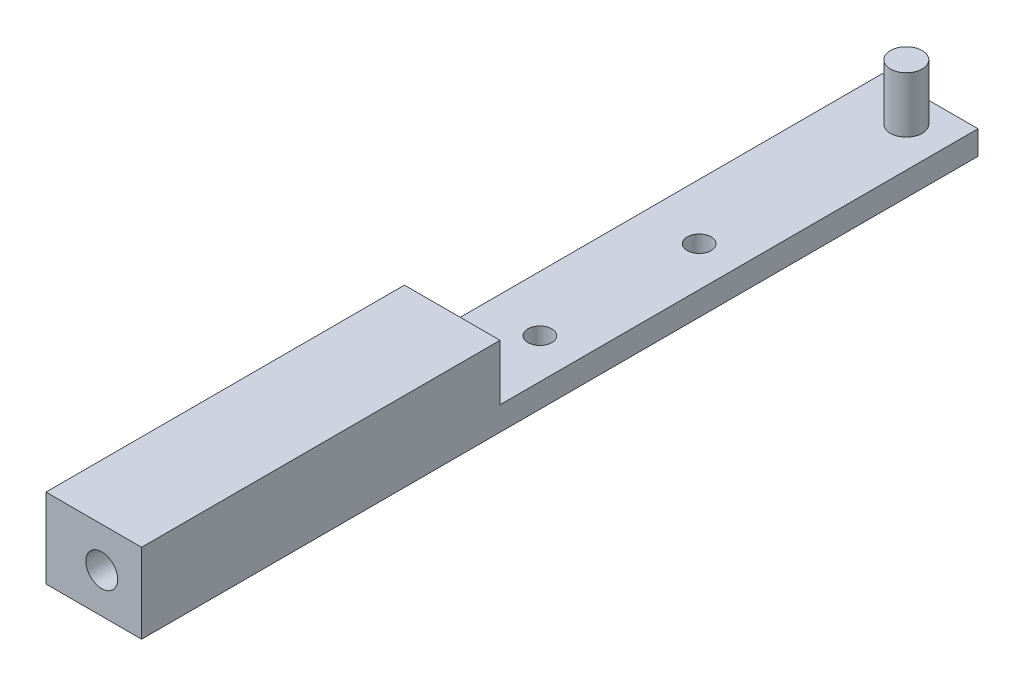
ISO-10303-21;
HEADER;
FILE_DESCRIPTION(('STEP AP214'),'2;1');
FILE_NAME('part.step','',(''),(''),'','','');
FILE_SCHEMA(('AUTOMOTIVE_DESIGN { 1 0 10303 214 1 1 1 1 }'));
ENDSEC;
DATA;
#1=APPLICATION_CONTEXT('core data for automotive mechanical design processes');
#2=APPLICATION_PROTOCOL_DEFINITION('international standard','automotive_design',2000,#1);
#3=PRODUCT_CONTEXT('',#1,'mechanical');
#4=PRODUCT('Part','Part','',(#3));
#5=PRODUCT_RELATED_PRODUCT_CATEGORY('part','',(#4));
#6=PRODUCT_DEFINITION_FORMATION('','',#4);
#7=PRODUCT_DEFINITION_CONTEXT('part definition',#1,'design');
#8=PRODUCT_DEFINITION('design','',#6,#7);
#9=PRODUCT_DEFINITION_SHAPE('','',#8);
#10=(LENGTH_UNIT() NAMED_UNIT(*) SI_UNIT(.MILLI.,.METRE.));
#11=(NAMED_UNIT(*) PLANE_ANGLE_UNIT() SI_UNIT($,.RADIAN.));
#12=(NAMED_UNIT(*) SI_UNIT($,.STERADIAN.) SOLID_ANGLE_UNIT());
#13=UNCERTAINTY_MEASURE_WITH_UNIT(LENGTH_MEASURE(1.E-05),#10,'distance_accuracy_value','');
#14=(GEOMETRIC_REPRESENTATION_CONTEXT(3) GLOBAL_UNCERTAINTY_ASSIGNED_CONTEXT((#13)) GLOBAL_UNIT_ASSIGNED_CONTEXT((#10,
#11,#12)) REPRESENTATION_CONTEXT('',''));
#15=CARTESIAN_POINT('',(0.,0.,0.));
#16=DIRECTION('',(0.,0.,1.));
#17=DIRECTION('',(1.,0.,0.));
#18=AXIS2_PLACEMENT_3D('',#15,#16,#17);
#19=CARTESIAN_POINT('',(4.99999999999999,10.,-52.5));
#20=DIRECTION('',(-1.,0.,0.));
#21=DIRECTION('',(0.,0.,1.));
#22=AXIS2_PLACEMENT_3D('',#19,#20,#21);
#23=PLANE('',#22);
#24=DIRECTION('',(0.,-1.,0.));
#25=VECTOR('',#24,1.);
#26=CARTESIAN_POINT('',(5.,9.99999999999999,7.50000000000001));
#27=LINE('',#26,#25);
#28=CARTESIAN_POINT('',(5.00000000000001,10.,7.50000000000001));
#29=VERTEX_POINT('',#28);
#30=CARTESIAN_POINT('',(5.,2.99999999999999,7.50000000000001));
#31=VERTEX_POINT('',#30);
#32=EDGE_CURVE('E97',#29,#31,#27,.T.);
#33=ORIENTED_EDGE('',*,*,#32,.F.);
#34=DIRECTION('',(0.,0.,-1.));
#35=VECTOR('',#34,1.);
#36=CARTESIAN_POINT('',(4.99999999999999,10.,-52.5));
#37=LINE('',#36,#35);
#38=CARTESIAN_POINT('',(5.00000000000001,10.,52.5));
#39=VERTEX_POINT('',#38);
#40=EDGE_CURVE('E144',#39,#29,#37,.T.);
#41=ORIENTED_EDGE('',*,*,#40,.F.);
#42=DIRECTION('',(0.,-1.,0.));
#43=VECTOR('',#42,1.);
#44=CARTESIAN_POINT('',(5.00000000000001,10.,52.5));
#45=LINE('',#44,#43);
#46=CARTESIAN_POINT('',(5.00000000000001,0.,52.5));
#47=VERTEX_POINT('',#46);
#48=EDGE_CURVE('E148',#39,#47,#45,.T.);
#49=ORIENTED_EDGE('',*,*,#48,.T.);
#50=DIRECTION('',(0.,0.,-1.));
#51=VECTOR('',#50,1.);
#52=CARTESIAN_POINT('',(4.99999999999999,0.,-52.5));
#53=LINE('',#52,#51);
#54=CARTESIAN_POINT('',(4.99999999999999,0.,-52.5));
#55=VERTEX_POINT('',#54);
#56=EDGE_CURVE('E143',#47,#55,#53,.T.);
#57=ORIENTED_EDGE('',*,*,#56,.T.);
#58=DIRECTION('',(0.,-1.,0.));
#59=VECTOR('',#58,1.);
#60=CARTESIAN_POINT('',(4.99999999999999,10.,-52.5));
#61=LINE('',#60,#59);
#62=CARTESIAN_POINT('',(4.99999999999999,3.,-52.5));
#63=VERTEX_POINT('',#62);
#64=EDGE_CURVE('E43',#63,#55,#61,.T.);
#65=ORIENTED_EDGE('',*,*,#64,.F.);
#66=DIRECTION('',(0.,0.,-1.));
#67=VECTOR('',#66,1.);
#68=CARTESIAN_POINT('',(4.99999999999999,3.,-52.5));
#69=LINE('',#68,#67);
#70=EDGE_CURVE('E70',#31,#63,#69,.T.);
#71=ORIENTED_EDGE('',*,*,#70,.F.);
#72=EDGE_LOOP('',(#33,#41,#49,#57,#65,#71));
#73=FACE_BOUND('',#72,.T.);
#74=ADVANCED_FACE('F34',(#73),#23,.F.);
#75=CARTESIAN_POINT('',(-5.00000000000001,10.,-52.5));
#76=DIRECTION('',(0.,0.,1.));
#77=DIRECTION('',(1.,0.,0.));
#78=AXIS2_PLACEMENT_3D('',#75,#76,#77);
#79=PLANE('',#78);
#80=DIRECTION('',(-1.,0.,0.));
#81=VECTOR('',#80,1.);
#82=CARTESIAN_POINT('',(10.,3.,-52.5));
#83=LINE('',#82,#81);
#84=CARTESIAN_POINT('',(-7.00000000000001,3.,-52.5));
#85=VERTEX_POINT('',#84);
#86=EDGE_CURVE('E98',#63,#85,#83,.T.);
#87=ORIENTED_EDGE('',*,*,#86,.F.);
#88=ORIENTED_EDGE('',*,*,#64,.T.);
#89=DIRECTION('',(-1.,0.,0.));
#90=VECTOR('',#89,1.);
#91=CARTESIAN_POINT('',(-5.00000000000001,0.,-52.5));
#92=LINE('',#91,#90);
#93=CARTESIAN_POINT('',(-7.00000000000001,0.,-52.5));
#94=VERTEX_POINT('',#93);
#95=EDGE_CURVE('E151',#55,#94,#92,.T.);
#96=ORIENTED_EDGE('',*,*,#95,.T.);
#97=DIRECTION('',(0.,-1.,0.));
#98=VECTOR('',#97,1.);
#99=CARTESIAN_POINT('',(-7.00000000000001,0.,-52.5));
#100=LINE('',#99,#98);
#101=EDGE_CURVE('E106',#85,#94,#100,.T.);
#102=ORIENTED_EDGE('',*,*,#101,.F.);
#103=EDGE_LOOP('',(#87,#88,#96,#102));
#104=FACE_BOUND('',#103,.T.);
#105=ADVANCED_FACE('F186',(#104),#79,.F.);
#106=CARTESIAN_POINT('',(0.,10.,0.));
#107=DIRECTION('',(0.,1.,0.));
#108=DIRECTION('',(0.,0.,1.));
#109=AXIS2_PLACEMENT_3D('',#106,#107,#108);
#110=PLANE('',#109);
#111=ORIENTED_EDGE('',*,*,#40,.T.);
#112=DIRECTION('',(-1.,0.,0.));
#113=VECTOR('',#112,1.);
#114=CARTESIAN_POINT('',(0.,10.,7.50000000000001));
#115=LINE('',#114,#113);
#116=CARTESIAN_POINT('',(-7.,10.,7.50000000000001));
#117=VERTEX_POINT('',#116);
#118=EDGE_CURVE('E11',#29,#117,#115,.T.);
#119=ORIENTED_EDGE('',*,*,#118,.T.);
#120=DIRECTION('',(0.,0.,-1.));
#121=VECTOR('',#120,1.);
#122=CARTESIAN_POINT('',(-7.,10.,7.50000000000001));
#123=LINE('',#122,#121);
#124=CARTESIAN_POINT('',(-6.99999999999999,10.,52.5));
#125=VERTEX_POINT('',#124);
#126=EDGE_CURVE('E111',#125,#117,#123,.T.);
#127=ORIENTED_EDGE('',*,*,#126,.F.);
#128=DIRECTION('',(1.,0.,0.));
#129=VECTOR('',#128,1.);
#130=CARTESIAN_POINT('',(-4.99999999999999,10.,52.5));
#131=LINE('',#130,#129);
#132=EDGE_CURVE('E51',#125,#39,#131,.T.);
#133=ORIENTED_EDGE('',*,*,#132,.T.);
#134=EDGE_LOOP('',(#111,#119,#127,#133));
#135=FACE_BOUND('',#134,.T.);
#136=ADVANCED_FACE('F184',(#135),#110,.T.);
#137=CARTESIAN_POINT('',(-4.99999999999999,10.,52.5));
#138=DIRECTION('',(0.,0.,-1.));
#139=DIRECTION('',(-1.,0.,0.));
#140=AXIS2_PLACEMENT_3D('',#137,#138,#139);
#141=PLANE('',#140);
#142=CARTESIAN_POINT('',(0.,5.,52.5));
#143=DIRECTION('',(0.,0.,1.));
#144=DIRECTION('',(1.,0.,0.));
#145=AXIS2_PLACEMENT_3D('',#142,#143,#144);
#146=CIRCLE('',#145,2.);
#147=CARTESIAN_POINT('',(2.,5.,52.5));
#148=VERTEX_POINT('',#147);
#149=EDGE_CURVE('E121',#148,#148,#146,.T.);
#150=ORIENTED_EDGE('',*,*,#149,.F.);
#151=EDGE_LOOP('',(#150));
#152=FACE_BOUND('',#151,.T.);
#153=DIRECTION('',(1.,0.,0.));
#154=VECTOR('',#153,1.);
#155=CARTESIAN_POINT('',(-4.99999999999999,0.,52.5));
#156=LINE('',#155,#154);
#157=CARTESIAN_POINT('',(-6.99999999999999,0.,52.5));
#158=VERTEX_POINT('',#157);
#159=EDGE_CURVE('E146',#158,#47,#156,.T.);
#160=ORIENTED_EDGE('',*,*,#159,.T.);
#161=ORIENTED_EDGE('',*,*,#48,.F.);
#162=ORIENTED_EDGE('',*,*,#132,.F.);
#163=DIRECTION('',(0.,1.,0.));
#164=VECTOR('',#163,1.);
#165=CARTESIAN_POINT('',(-6.99999999999999,10.,52.5));
#166=LINE('',#165,#164);
#167=EDGE_CURVE('E118',#158,#125,#166,.T.);
#168=ORIENTED_EDGE('',*,*,#167,.F.);
#169=EDGE_LOOP('',(#160,#161,#162,#168));
#170=FACE_BOUND('',#169,.T.);
#171=ADVANCED_FACE('F174',(#152,#170),#141,.F.);
#172=CARTESIAN_POINT('',(0.,0.,0.));
#173=DIRECTION('',(0.,1.,0.));
#174=DIRECTION('',(0.,0.,1.));
#175=AXIS2_PLACEMENT_3D('',#172,#173,#174);
#176=PLANE('',#175);
#177=CARTESIAN_POINT('',(0.,0.,-2.49999999999999));
#178=DIRECTION('',(0.,1.,0.));
#179=DIRECTION('',(0.,0.,1.));
#180=AXIS2_PLACEMENT_3D('',#177,#178,#179);
#181=CIRCLE('',#180,1.5);
#182=CARTESIAN_POINT('',(0.,0.,-0.999999999999988));
#183=VERTEX_POINT('',#182);
#184=EDGE_CURVE('E128',#183,#183,#181,.T.);
#185=ORIENTED_EDGE('',*,*,#184,.T.);
#186=EDGE_LOOP('',(#185));
#187=FACE_BOUND('',#186,.T.);
#188=CARTESIAN_POINT('',(0.,0.,-22.5));
#189=DIRECTION('',(0.,1.,0.));
#190=DIRECTION('',(0.,0.,1.));
#191=AXIS2_PLACEMENT_3D('',#188,#189,#190);
#192=CIRCLE('',#191,1.5);
#193=CARTESIAN_POINT('',(0.,0.,-21.));
#194=VERTEX_POINT('',#193);
#195=EDGE_CURVE('E125',#194,#194,#192,.T.);
#196=ORIENTED_EDGE('',*,*,#195,.T.);
#197=EDGE_LOOP('',(#196));
#198=FACE_BOUND('',#197,.T.);
#199=ORIENTED_EDGE('',*,*,#56,.F.);
#200=ORIENTED_EDGE('',*,*,#159,.F.);
#201=DIRECTION('',(0.,0.,1.));
#202=VECTOR('',#201,1.);
#203=CARTESIAN_POINT('',(-6.99999999999999,0.,52.5));
#204=LINE('',#203,#202);
#205=EDGE_CURVE('E115',#94,#158,#204,.T.);
#206=ORIENTED_EDGE('',*,*,#205,.F.);
#207=ORIENTED_EDGE('',*,*,#95,.F.);
#208=EDGE_LOOP('',(#199,#200,#206,#207));
#209=FACE_BOUND('',#208,.T.);
#210=ADVANCED_FACE('F171',(#187,#198,#209),#176,.F.);
#211=CARTESIAN_POINT('',(10.,3.,-52.5));
#212=DIRECTION('',(0.,1.,0.));
#213=DIRECTION('',(0.,0.,1.));
#214=AXIS2_PLACEMENT_3D('',#211,#212,#213);
#215=PLANE('',#214);
#216=CARTESIAN_POINT('',(0.,2.99999999999999,-2.49999999999999));
#217=DIRECTION('',(0.,1.,0.));
#218=DIRECTION('',(0.,0.,1.));
#219=AXIS2_PLACEMENT_3D('',#216,#217,#218);
#220=CIRCLE('',#219,1.5);
#221=CARTESIAN_POINT('',(0.,2.99999999999999,-0.999999999999988));
#222=VERTEX_POINT('',#221);
#223=EDGE_CURVE('E37',#222,#222,#220,.F.);
#224=ORIENTED_EDGE('',*,*,#223,.T.);
#225=EDGE_LOOP('',(#224));
#226=FACE_BOUND('',#225,.T.);
#227=CARTESIAN_POINT('',(0.,3.,-22.5));
#228=DIRECTION('',(0.,1.,0.));
#229=DIRECTION('',(0.,0.,1.));
#230=AXIS2_PLACEMENT_3D('',#227,#228,#229);
#231=CIRCLE('',#230,1.5);
#232=CARTESIAN_POINT('',(0.,3.,-21.));
#233=VERTEX_POINT('',#232);
#234=EDGE_CURVE('E131',#233,#233,#231,.F.);
#235=ORIENTED_EDGE('',*,*,#234,.T.);
#236=EDGE_LOOP('',(#235));
#237=FACE_BOUND('',#236,.T.);
#238=CARTESIAN_POINT('',(0.,3.,-48.5));
#239=DIRECTION('',(0.,1.,0.));
#240=DIRECTION('',(0.,0.,1.));
#241=AXIS2_PLACEMENT_3D('',#238,#239,#240);
#242=CIRCLE('',#241,2.);
#243=CARTESIAN_POINT('',(0.,3.,-46.5));
#244=VERTEX_POINT('',#243);
#245=EDGE_CURVE('E137',#244,#244,#242,.T.);
#246=ORIENTED_EDGE('',*,*,#245,.F.);
#247=EDGE_LOOP('',(#246));
#248=FACE_BOUND('',#247,.T.);
#249=ORIENTED_EDGE('',*,*,#70,.T.);
#250=ORIENTED_EDGE('',*,*,#86,.T.);
#251=DIRECTION('',(0.,0.,-1.));
#252=VECTOR('',#251,1.);
#253=CARTESIAN_POINT('',(-7.00000000000001,3.,-52.5));
#254=LINE('',#253,#252);
#255=CARTESIAN_POINT('',(-7.,2.99999999999999,7.50000000000001));
#256=VERTEX_POINT('',#255);
#257=EDGE_CURVE('E101',#256,#85,#254,.T.);
#258=ORIENTED_EDGE('',*,*,#257,.F.);
#259=DIRECTION('',(-1.,0.,0.));
#260=VECTOR('',#259,1.);
#261=CARTESIAN_POINT('',(10.,2.99999999999999,7.50000000000001));
#262=LINE('',#261,#260);
#263=EDGE_CURVE('E92',#31,#256,#262,.T.);
#264=ORIENTED_EDGE('',*,*,#263,.F.);
#265=EDGE_LOOP('',(#249,#250,#258,#264));
#266=FACE_BOUND('',#265,.T.);
#267=ADVANCED_FACE('F102',(#226,#237,#248,#266),#215,.T.);
#268=CARTESIAN_POINT('',(10.,16.0957121015767,7.50000000000001));
#269=DIRECTION('',(0.,0.,-1.));
#270=DIRECTION('',(0.,1.,0.));
#271=AXIS2_PLACEMENT_3D('',#268,#269,#270);
#272=PLANE('',#271);
#273=ORIENTED_EDGE('',*,*,#32,.T.);
#274=ORIENTED_EDGE('',*,*,#263,.T.);
#275=DIRECTION('',(0.,-1.,0.));
#276=VECTOR('',#275,1.);
#277=CARTESIAN_POINT('',(-7.,2.99999999999999,7.50000000000001));
#278=LINE('',#277,#276);
#279=EDGE_CURVE('E96',#117,#256,#278,.T.);
#280=ORIENTED_EDGE('',*,*,#279,.F.);
#281=ORIENTED_EDGE('',*,*,#118,.F.);
#282=EDGE_LOOP('',(#273,#274,#280,#281));
#283=FACE_BOUND('',#282,.T.);
#284=ADVANCED_FACE('F94',(#283),#272,.T.);
#285=CARTESIAN_POINT('',(0.,10.,-48.5));
#286=DIRECTION('',(0.,-1.,0.));
#287=DIRECTION('',(0.,0.,-1.));
#288=AXIS2_PLACEMENT_3D('',#285,#286,#287);
#289=CYLINDRICAL_SURFACE('',#288,2.);
#290=CARTESIAN_POINT('',(0.,10.,-48.5));
#291=DIRECTION('',(0.,1.,0.));
#292=DIRECTION('',(0.,0.,1.));
#293=AXIS2_PLACEMENT_3D('',#290,#291,#292);
#294=CIRCLE('',#293,2.);
#295=CARTESIAN_POINT('',(0.,10.,-46.5));
#296=VERTEX_POINT('',#295);
#297=EDGE_CURVE('E134',#296,#296,#294,.T.);
#298=ORIENTED_EDGE('',*,*,#297,.F.);
#299=EDGE_LOOP('',(#298));
#300=FACE_BOUND('',#299,.T.);
#301=ORIENTED_EDGE('',*,*,#245,.T.);
#302=EDGE_LOOP('',(#301));
#303=FACE_BOUND('',#302,.T.);
#304=ADVANCED_FACE('F247',(#300,#303),#289,.T.);
#305=CARTESIAN_POINT('',(0.,10.,-48.5));
#306=DIRECTION('',(0.,1.,0.));
#307=DIRECTION('',(0.,0.,1.));
#308=AXIS2_PLACEMENT_3D('',#305,#306,#307);
#309=PLANE('',#308);
#310=ORIENTED_EDGE('',*,*,#297,.T.);
#311=EDGE_LOOP('',(#310));
#312=FACE_BOUND('',#311,.T.);
#313=ADVANCED_FACE('F277',(#312),#309,.T.);
#314=CARTESIAN_POINT('',(0.,14.,-22.5));
#315=DIRECTION('',(0.,-1.,0.));
#316=DIRECTION('',(0.,0.,-1.));
#317=AXIS2_PLACEMENT_3D('',#314,#315,#316);
#318=CYLINDRICAL_SURFACE('',#317,1.5);
#319=ORIENTED_EDGE('',*,*,#234,.F.);
#320=EDGE_LOOP('',(#319));
#321=FACE_BOUND('',#320,.T.);
#322=ORIENTED_EDGE('',*,*,#195,.F.);
#323=EDGE_LOOP('',(#322));
#324=FACE_BOUND('',#323,.T.);
#325=ADVANCED_FACE('F167',(#321,#324),#318,.F.);
#326=CARTESIAN_POINT('',(0.,14.,-2.49999999999999));
#327=DIRECTION('',(0.,-1.,0.));
#328=DIRECTION('',(0.,0.,-1.));
#329=AXIS2_PLACEMENT_3D('',#326,#327,#328);
#330=CYLINDRICAL_SURFACE('',#329,1.5);
#331=ORIENTED_EDGE('',*,*,#223,.F.);
#332=EDGE_LOOP('',(#331));
#333=FACE_BOUND('',#332,.T.);
#334=ORIENTED_EDGE('',*,*,#184,.F.);
#335=EDGE_LOOP('',(#334));
#336=FACE_BOUND('',#335,.T.);
#337=ADVANCED_FACE('F163',(#333,#336),#330,.F.);
#338=CARTESIAN_POINT('',(0.,5.,42.5));
#339=DIRECTION('',(0.,0.,1.));
#340=DIRECTION('',(1.,0.,0.));
#341=AXIS2_PLACEMENT_3D('',#338,#339,#340);
#342=CYLINDRICAL_SURFACE('',#341,2.);
#343=CARTESIAN_POINT('',(0.,5.,42.5));
#344=DIRECTION('',(0.,0.,1.));
#345=DIRECTION('',(1.,0.,0.));
#346=AXIS2_PLACEMENT_3D('',#343,#344,#345);
#347=CIRCLE('',#346,2.);
#348=CARTESIAN_POINT('',(2.,5.,42.5));
#349=VERTEX_POINT('',#348);
#350=EDGE_CURVE('E122',#349,#349,#347,.T.);
#351=ORIENTED_EDGE('',*,*,#350,.F.);
#352=EDGE_LOOP('',(#351));
#353=FACE_BOUND('',#352,.T.);
#354=ORIENTED_EDGE('',*,*,#149,.T.);
#355=EDGE_LOOP('',(#354));
#356=FACE_BOUND('',#355,.T.);
#357=ADVANCED_FACE('F166',(#353,#356),#342,.F.);
#358=CARTESIAN_POINT('',(0.,5.,42.5));
#359=DIRECTION('',(0.,0.,1.));
#360=DIRECTION('',(1.,0.,0.));
#361=AXIS2_PLACEMENT_3D('',#358,#359,#360);
#362=PLANE('',#361);
#363=ORIENTED_EDGE('',*,*,#350,.T.);
#364=EDGE_LOOP('',(#363));
#365=FACE_BOUND('',#364,.T.);
#366=ADVANCED_FACE('F211',(#365),#362,.T.);
#367=CARTESIAN_POINT('',(-7.,0.,0.));
#368=DIRECTION('',(1.,0.,0.));
#369=DIRECTION('',(0.,0.,-1.));
#370=AXIS2_PLACEMENT_3D('',#367,#368,#369);
#371=PLANE('',#370);
#372=ORIENTED_EDGE('',*,*,#279,.T.);
#373=ORIENTED_EDGE('',*,*,#257,.T.);
#374=ORIENTED_EDGE('',*,*,#101,.T.);
#375=ORIENTED_EDGE('',*,*,#205,.T.);
#376=ORIENTED_EDGE('',*,*,#167,.T.);
#377=ORIENTED_EDGE('',*,*,#126,.T.);
#378=EDGE_LOOP('',(#372,#373,#374,#375,#376,#377));
#379=FACE_BOUND('',#378,.T.);
#380=ADVANCED_FACE('F109',(#379),#371,.F.);
#381=CLOSED_SHELL('',(#74,#105,#136,#171,#210,#267,#284,#304,#313,#325,#337,#357,#366,#380));
#382=MANIFOLD_SOLID_BREP('B2',#381);
#383=ADVANCED_BREP_SHAPE_REPRESENTATION('',(#18,#382),#14);
#384=SHAPE_DEFINITION_REPRESENTATION(#9,#383);
ENDSEC;
END-ISO-10303-21;
